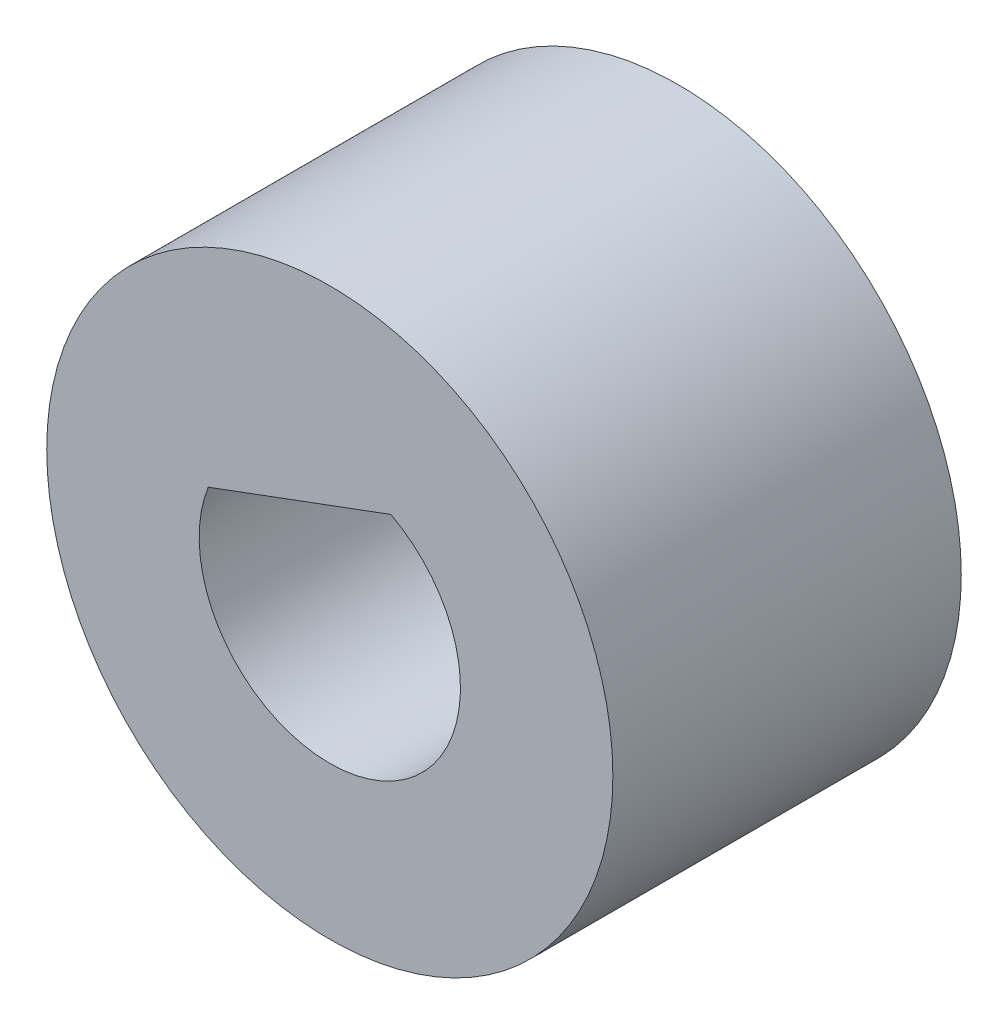
ISO-10303-21;
HEADER;
FILE_DESCRIPTION(('STEP AP214'),'2;1');
FILE_NAME('part.step','',(''),(''),'','','');
FILE_SCHEMA(('AUTOMOTIVE_DESIGN { 1 0 10303 214 1 1 1 1 }'));
ENDSEC;
DATA;
#1=APPLICATION_CONTEXT('core data for automotive mechanical design processes');
#2=APPLICATION_PROTOCOL_DEFINITION('international standard','automotive_design',2000,#1);
#3=PRODUCT_CONTEXT('',#1,'mechanical');
#4=PRODUCT('Part','Part','',(#3));
#5=PRODUCT_RELATED_PRODUCT_CATEGORY('part','',(#4));
#6=PRODUCT_DEFINITION_FORMATION('','',#4);
#7=PRODUCT_DEFINITION_CONTEXT('part definition',#1,'design');
#8=PRODUCT_DEFINITION('design','',#6,#7);
#9=PRODUCT_DEFINITION_SHAPE('','',#8);
#10=(LENGTH_UNIT() NAMED_UNIT(*) SI_UNIT(.MILLI.,.METRE.));
#11=(NAMED_UNIT(*) PLANE_ANGLE_UNIT() SI_UNIT($,.RADIAN.));
#12=(NAMED_UNIT(*) SI_UNIT($,.STERADIAN.) SOLID_ANGLE_UNIT());
#13=UNCERTAINTY_MEASURE_WITH_UNIT(LENGTH_MEASURE(1.E-05),#10,'distance_accuracy_value','');
#14=(GEOMETRIC_REPRESENTATION_CONTEXT(3) GLOBAL_UNCERTAINTY_ASSIGNED_CONTEXT((#13)) GLOBAL_UNIT_ASSIGNED_CONTEXT((#10,
#11,#12)) REPRESENTATION_CONTEXT('',''));
#15=CARTESIAN_POINT('',(0.,0.,0.));
#16=DIRECTION('',(0.,0.,1.));
#17=DIRECTION('',(1.,0.,0.));
#18=AXIS2_PLACEMENT_3D('',#15,#16,#17);
#19=CARTESIAN_POINT('',(0.,0.,4.));
#20=DIRECTION('',(0.,0.,1.));
#21=DIRECTION('',(1.,0.,0.));
#22=AXIS2_PLACEMENT_3D('',#19,#20,#21);
#23=PLANE('',#22);
#24=CARTESIAN_POINT('',(0.,0.,4.));
#25=DIRECTION('',(0.,0.,1.));
#26=DIRECTION('',(1.,0.,0.));
#27=AXIS2_PLACEMENT_3D('',#24,#25,#26);
#28=CIRCLE('',#27,3.25);
#29=CARTESIAN_POINT('',(3.25,0.,4.));
#30=VERTEX_POINT('',#29);
#31=EDGE_CURVE('E11',#30,#30,#28,.T.);
#32=ORIENTED_EDGE('',*,*,#31,.T.);
#33=EDGE_LOOP('',(#32));
#34=FACE_BOUND('',#33,.T.);
#35=CARTESIAN_POINT('',(0.,0.,4.));
#36=DIRECTION('',(0.,0.,1.));
#37=DIRECTION('',(1.,0.,0.));
#38=AXIS2_PLACEMENT_3D('',#35,#36,#37);
#39=CIRCLE('',#38,1.5);
#40=CARTESIAN_POINT('',(-1.39586162596188,0.549154187061395,4.));
#41=VERTEX_POINT('',#40);
#42=CARTESIAN_POINT('',(0.700849555061505,1.32620130491946,4.));
#43=VERTEX_POINT('',#42);
#44=EDGE_CURVE('E82',#41,#43,#39,.T.);
#45=ORIENTED_EDGE('',*,*,#44,.F.);
#46=DIRECTION('',(0.93767774599043,0.347506035450187,0.));
#47=VECTOR('',#46,1.);
#48=CARTESIAN_POINT('',(-0.347506035450187,0.93767774599043,4.));
#49=LINE('',#48,#47);
#50=EDGE_CURVE('E71',#41,#43,#49,.T.);
#51=ORIENTED_EDGE('',*,*,#50,.T.);
#52=EDGE_LOOP('',(#45,#51));
#53=FACE_BOUND('',#52,.T.);
#54=ADVANCED_FACE('F45',(#34,#53),#23,.T.);
#55=CARTESIAN_POINT('',(0.,0.,0.));
#56=DIRECTION('',(0.,0.,1.));
#57=DIRECTION('',(1.,0.,0.));
#58=AXIS2_PLACEMENT_3D('',#55,#56,#57);
#59=PLANE('',#58);
#60=CARTESIAN_POINT('',(0.,0.,0.));
#61=DIRECTION('',(0.,0.,1.));
#62=DIRECTION('',(1.,0.,0.));
#63=AXIS2_PLACEMENT_3D('',#60,#61,#62);
#64=CIRCLE('',#63,3.25);
#65=CARTESIAN_POINT('',(3.25,0.,0.));
#66=VERTEX_POINT('',#65);
#67=EDGE_CURVE('E49',#66,#66,#64,.T.);
#68=ORIENTED_EDGE('',*,*,#67,.F.);
#69=EDGE_LOOP('',(#68));
#70=FACE_BOUND('',#69,.T.);
#71=CARTESIAN_POINT('',(0.,0.,0.));
#72=DIRECTION('',(0.,0.,1.));
#73=DIRECTION('',(1.,0.,0.));
#74=AXIS2_PLACEMENT_3D('',#71,#72,#73);
#75=CIRCLE('',#74,1.5);
#76=CARTESIAN_POINT('',(-1.39586162596188,0.549154187061395,0.));
#77=VERTEX_POINT('',#76);
#78=CARTESIAN_POINT('',(0.700849555061505,1.32620130491946,0.));
#79=VERTEX_POINT('',#78);
#80=EDGE_CURVE('E84',#77,#79,#75,.T.);
#81=ORIENTED_EDGE('',*,*,#80,.T.);
#82=DIRECTION('',(-0.93767774599043,-0.347506035450187,0.));
#83=VECTOR('',#82,1.);
#84=CARTESIAN_POINT('',(-0.347506035450187,0.93767774599043,0.));
#85=LINE('',#84,#83);
#86=EDGE_CURVE('E65',#79,#77,#85,.T.);
#87=ORIENTED_EDGE('',*,*,#86,.T.);
#88=EDGE_LOOP('',(#81,#87));
#89=FACE_BOUND('',#88,.T.);
#90=ADVANCED_FACE('F98',(#70,#89),#59,.F.);
#91=CARTESIAN_POINT('',(0.,0.,4.));
#92=DIRECTION('',(0.,0.,-1.));
#93=DIRECTION('',(-1.,0.,0.));
#94=AXIS2_PLACEMENT_3D('',#91,#92,#93);
#95=CYLINDRICAL_SURFACE('',#94,3.25);
#96=ORIENTED_EDGE('',*,*,#31,.F.);
#97=EDGE_LOOP('',(#96));
#98=FACE_BOUND('',#97,.T.);
#99=ORIENTED_EDGE('',*,*,#67,.T.);
#100=EDGE_LOOP('',(#99));
#101=FACE_BOUND('',#100,.T.);
#102=ADVANCED_FACE('F47',(#98,#101),#95,.T.);
#103=CARTESIAN_POINT('',(0.,0.,4.));
#104=DIRECTION('',(0.,0.,-1.));
#105=DIRECTION('',(-1.,0.,0.));
#106=AXIS2_PLACEMENT_3D('',#103,#104,#105);
#107=CYLINDRICAL_SURFACE('',#106,1.5);
#108=DIRECTION('',(0.,0.,1.));
#109=VECTOR('',#108,1.);
#110=CARTESIAN_POINT('',(-1.39586162596188,0.549154187061395,-2.30223924399949));
#111=LINE('',#110,#109);
#112=EDGE_CURVE('E61',#77,#41,#111,.T.);
#113=ORIENTED_EDGE('',*,*,#112,.T.);
#114=ORIENTED_EDGE('',*,*,#44,.T.);
#115=DIRECTION('',(0.,0.,1.));
#116=VECTOR('',#115,1.);
#117=CARTESIAN_POINT('',(0.700849555061505,1.32620130491946,-2.30223924399949));
#118=LINE('',#117,#116);
#119=EDGE_CURVE('E73',#79,#43,#118,.T.);
#120=ORIENTED_EDGE('',*,*,#119,.F.);
#121=ORIENTED_EDGE('',*,*,#80,.F.);
#122=EDGE_LOOP('',(#113,#114,#120,#121));
#123=FACE_BOUND('',#122,.T.);
#124=ADVANCED_FACE('F81',(#123),#107,.F.);
#125=CARTESIAN_POINT('',(-0.347506035450187,0.93767774599043,-2.30223924399949));
#126=DIRECTION('',(0.347506035450187,-0.93767774599043,0.));
#127=DIRECTION('',(0.93767774599043,0.347506035450187,0.));
#128=AXIS2_PLACEMENT_3D('',#125,#126,#127);
#129=PLANE('',#128);
#130=ORIENTED_EDGE('',*,*,#86,.F.);
#131=ORIENTED_EDGE('',*,*,#119,.T.);
#132=ORIENTED_EDGE('',*,*,#50,.F.);
#133=ORIENTED_EDGE('',*,*,#112,.F.);
#134=EDGE_LOOP('',(#130,#131,#132,#133));
#135=FACE_BOUND('',#134,.T.);
#136=ADVANCED_FACE('F72',(#135),#129,.T.);
#137=CLOSED_SHELL('',(#54,#90,#102,#124,#136));
#138=MANIFOLD_SOLID_BREP('B2',#137);
#139=ADVANCED_BREP_SHAPE_REPRESENTATION('',(#18,#138),#14);
#140=SHAPE_DEFINITION_REPRESENTATION(#9,#139);
ENDSEC;
END-ISO-10303-21;
